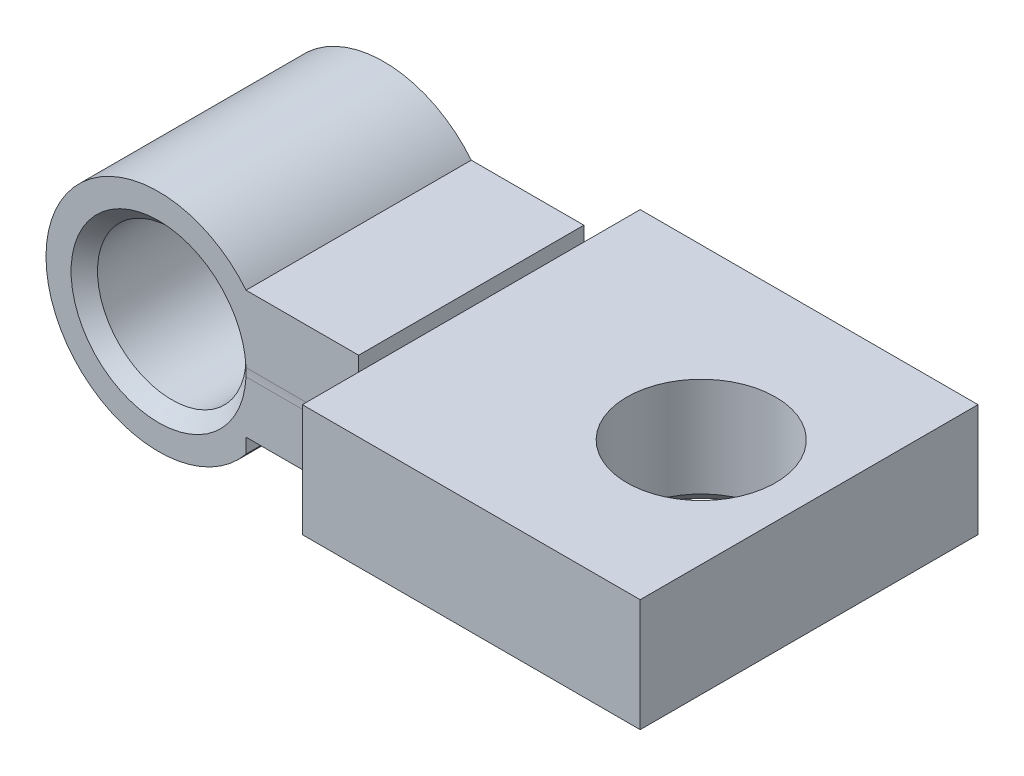
ISO-10303-21;
HEADER;
FILE_DESCRIPTION(('STEP AP214'),'2;1');
FILE_NAME('part.step','',(''),(''),'','','');
FILE_SCHEMA(('AUTOMOTIVE_DESIGN { 1 0 10303 214 1 1 1 1 }'));
ENDSEC;
DATA;
#1=APPLICATION_CONTEXT('core data for automotive mechanical design processes');
#2=APPLICATION_PROTOCOL_DEFINITION('international standard','automotive_design',2000,#1);
#3=PRODUCT_CONTEXT('',#1,'mechanical');
#4=PRODUCT('Part','Part','',(#3));
#5=PRODUCT_RELATED_PRODUCT_CATEGORY('part','',(#4));
#6=PRODUCT_DEFINITION_FORMATION('','',#4);
#7=PRODUCT_DEFINITION_CONTEXT('part definition',#1,'design');
#8=PRODUCT_DEFINITION('design','',#6,#7);
#9=PRODUCT_DEFINITION_SHAPE('','',#8);
#10=(LENGTH_UNIT() NAMED_UNIT(*) SI_UNIT(.MILLI.,.METRE.));
#11=(NAMED_UNIT(*) PLANE_ANGLE_UNIT() SI_UNIT($,.RADIAN.));
#12=(NAMED_UNIT(*) SI_UNIT($,.STERADIAN.) SOLID_ANGLE_UNIT());
#13=UNCERTAINTY_MEASURE_WITH_UNIT(LENGTH_MEASURE(1.E-05),#10,'distance_accuracy_value','');
#14=(GEOMETRIC_REPRESENTATION_CONTEXT(3) GLOBAL_UNCERTAINTY_ASSIGNED_CONTEXT((#13)) GLOBAL_UNIT_ASSIGNED_CONTEXT((#10,
#11,#12)) REPRESENTATION_CONTEXT('',''));
#15=CARTESIAN_POINT('',(0.,0.,0.));
#16=DIRECTION('',(0.,0.,1.));
#17=DIRECTION('',(1.,0.,0.));
#18=AXIS2_PLACEMENT_3D('',#15,#16,#17);
#19=CARTESIAN_POINT('',(3.88246984652232,-6.09266151445271,0.));
#20=DIRECTION('',(-1.,0.,0.));
#21=DIRECTION('',(0.,0.,1.));
#22=AXIS2_PLACEMENT_3D('',#19,#20,#21);
#23=PLANE('',#22);
#24=DIRECTION('',(0.,0.,-1.));
#25=VECTOR('',#24,1.);
#26=CARTESIAN_POINT('',(3.88246984652232,-2.5,0.));
#27=LINE('',#26,#25);
#28=CARTESIAN_POINT('',(3.88246984652232,-2.5,10.));
#29=VERTEX_POINT('',#28);
#30=CARTESIAN_POINT('',(3.88246984652232,-2.5,0.));
#31=VERTEX_POINT('',#30);
#32=EDGE_CURVE('E65',#29,#31,#27,.T.);
#33=ORIENTED_EDGE('',*,*,#32,.F.);
#34=DIRECTION('',(0.,-1.,0.));
#35=VECTOR('',#34,1.);
#36=CARTESIAN_POINT('',(3.88246984652232,-6.09266151445271,10.));
#37=LINE('',#36,#35);
#38=CARTESIAN_POINT('',(3.88246984652232,-3.1506234130478,10.));
#39=VERTEX_POINT('',#38);
#40=EDGE_CURVE('E239',#29,#39,#37,.T.);
#41=ORIENTED_EDGE('',*,*,#40,.T.);
#42=DIRECTION('',(0.,0.,-1.));
#43=VECTOR('',#42,1.);
#44=CARTESIAN_POINT('',(3.88246984652232,-3.1506234130478,10.));
#45=LINE('',#44,#43);
#46=CARTESIAN_POINT('',(3.88246984652232,-3.1506234130478,0.));
#47=VERTEX_POINT('',#46);
#48=EDGE_CURVE('E271',#47,#39,#45,.F.);
#49=ORIENTED_EDGE('',*,*,#48,.F.);
#50=DIRECTION('',(0.,-1.,0.));
#51=VECTOR('',#50,1.);
#52=CARTESIAN_POINT('',(3.88246984652232,-6.09266151445271,0.));
#53=LINE('',#52,#51);
#54=EDGE_CURVE('E259',#31,#47,#53,.T.);
#55=ORIENTED_EDGE('',*,*,#54,.F.);
#56=EDGE_LOOP('',(#33,#41,#49,#55));
#57=FACE_BOUND('',#56,.T.);
#58=ADVANCED_FACE('F40',(#57),#23,.F.);
#59=CARTESIAN_POINT('',(0.,0.,10.));
#60=DIRECTION('',(0.,0.,-1.));
#61=DIRECTION('',(-1.,0.,0.));
#62=AXIS2_PLACEMENT_3D('',#59,#60,#61);
#63=CYLINDRICAL_SURFACE('',#62,5.);
#64=CARTESIAN_POINT('',(0.,0.,0.));
#65=DIRECTION('',(0.,0.,1.));
#66=DIRECTION('',(1.,0.,0.));
#67=AXIS2_PLACEMENT_3D('',#64,#65,#66);
#68=CIRCLE('',#67,5.);
#69=CARTESIAN_POINT('',(3.88246984652232,3.1506234130478,0.));
#70=VERTEX_POINT('',#69);
#71=EDGE_CURVE('E282',#70,#47,#68,.T.);
#72=ORIENTED_EDGE('',*,*,#71,.T.);
#73=ORIENTED_EDGE('',*,*,#48,.T.);
#74=CARTESIAN_POINT('',(0.,0.,10.));
#75=DIRECTION('',(0.,0.,1.));
#76=DIRECTION('',(1.,0.,0.));
#77=AXIS2_PLACEMENT_3D('',#74,#75,#76);
#78=CIRCLE('',#77,5.);
#79=CARTESIAN_POINT('',(3.88246984652232,3.1506234130478,10.));
#80=VERTEX_POINT('',#79);
#81=EDGE_CURVE('E49',#80,#39,#78,.T.);
#82=ORIENTED_EDGE('',*,*,#81,.F.);
#83=DIRECTION('',(0.,0.,1.));
#84=VECTOR('',#83,1.);
#85=CARTESIAN_POINT('',(3.88246984652232,3.1506234130478,0.));
#86=LINE('',#85,#84);
#87=EDGE_CURVE('E268',#70,#80,#86,.T.);
#88=ORIENTED_EDGE('',*,*,#87,.F.);
#89=EDGE_LOOP('',(#72,#73,#82,#88));
#90=FACE_BOUND('',#89,.T.);
#91=ADVANCED_FACE('F42',(#90),#63,.T.);
#92=CARTESIAN_POINT('',(0.,0.,10.));
#93=DIRECTION('',(0.,0.,1.));
#94=DIRECTION('',(1.,0.,0.));
#95=AXIS2_PLACEMENT_3D('',#92,#93,#94);
#96=PLANE('',#95);
#97=CARTESIAN_POINT('',(0.,0.,10.));
#98=DIRECTION('',(0.,0.,1.));
#99=DIRECTION('',(1.,0.,0.));
#100=AXIS2_PLACEMENT_3D('',#97,#98,#99);
#101=CIRCLE('',#100,3.8865);
#102=CARTESIAN_POINT('',(3.88246984652232,0.176946717530785,10.));
#103=VERTEX_POINT('',#102);
#104=CARTESIAN_POINT('',(3.88246984652232,-0.176946717530785,10.));
#105=VERTEX_POINT('',#104);
#106=EDGE_CURVE('E279',#103,#105,#101,.T.);
#107=ORIENTED_EDGE('',*,*,#106,.F.);
#108=DIRECTION('',(-1.,0.,0.));
#109=VECTOR('',#108,1.);
#110=CARTESIAN_POINT('',(8.88246984652232,0.176946717530788,9.99999999999999));
#111=LINE('',#110,#109);
#112=CARTESIAN_POINT('',(8.88246984652232,0.176946717530788,9.99999999999999));
#113=VERTEX_POINT('',#112);
#114=EDGE_CURVE('E236',#113,#103,#111,.T.);
#115=ORIENTED_EDGE('',*,*,#114,.F.);
#116=DIRECTION('',(0.,-1.,0.));
#117=VECTOR('',#116,1.);
#118=CARTESIAN_POINT('',(8.88246984652232,0.,10.));
#119=LINE('',#118,#117);
#120=CARTESIAN_POINT('',(8.88246984652232,2.5,10.));
#121=VERTEX_POINT('',#120);
#122=EDGE_CURVE('E251',#121,#113,#119,.T.);
#123=ORIENTED_EDGE('',*,*,#122,.F.);
#124=CARTESIAN_POINT('',(8.88246984652232,3.1506234130478,10.));
#125=VERTEX_POINT('',#124);
#126=EDGE_CURVE('E244',#125,#121,#119,.T.);
#127=ORIENTED_EDGE('',*,*,#126,.F.);
#128=DIRECTION('',(-1.,0.,0.));
#129=VECTOR('',#128,1.);
#130=CARTESIAN_POINT('',(8.88246984652232,3.1506234130478,10.));
#131=LINE('',#130,#129);
#132=EDGE_CURVE('E232',#125,#80,#131,.T.);
#133=ORIENTED_EDGE('',*,*,#132,.T.);
#134=ORIENTED_EDGE('',*,*,#81,.T.);
#135=ORIENTED_EDGE('',*,*,#40,.F.);
#136=DIRECTION('',(-1.,0.,0.));
#137=VECTOR('',#136,1.);
#138=CARTESIAN_POINT('',(8.88246984652232,-2.5,10.));
#139=LINE('',#138,#137);
#140=CARTESIAN_POINT('',(8.88246984652232,-2.5,10.));
#141=VERTEX_POINT('',#140);
#142=EDGE_CURVE('E227',#141,#29,#139,.T.);
#143=ORIENTED_EDGE('',*,*,#142,.F.);
#144=DIRECTION('',(0.,-1.,0.));
#145=VECTOR('',#144,1.);
#146=CARTESIAN_POINT('',(8.88246984652232,0.,10.));
#147=LINE('',#146,#145);
#148=CARTESIAN_POINT('',(8.88246984652232,-0.176946717530786,10.));
#149=VERTEX_POINT('',#148);
#150=EDGE_CURVE('E228',#149,#141,#147,.T.);
#151=ORIENTED_EDGE('',*,*,#150,.F.);
#152=DIRECTION('',(-1.,0.,0.));
#153=VECTOR('',#152,1.);
#154=CARTESIAN_POINT('',(8.88246984652232,-0.176946717530786,10.));
#155=LINE('',#154,#153);
#156=EDGE_CURVE('E231',#149,#105,#155,.T.);
#157=ORIENTED_EDGE('',*,*,#156,.T.);
#158=EDGE_LOOP('',(#107,#115,#123,#127,#133,#134,#135,#143,#151,#157));
#159=FACE_BOUND('',#158,.T.);
#160=ADVANCED_FACE('F296',(#159),#96,.T.);
#161=CARTESIAN_POINT('',(0.,0.,0.));
#162=DIRECTION('',(0.,0.,1.));
#163=DIRECTION('',(1.,0.,0.));
#164=AXIS2_PLACEMENT_3D('',#161,#162,#163);
#165=PLANE('',#164);
#166=CARTESIAN_POINT('',(0.,0.,0.));
#167=DIRECTION('',(0.,0.,1.));
#168=DIRECTION('',(1.,0.,0.));
#169=AXIS2_PLACEMENT_3D('',#166,#167,#168);
#170=CIRCLE('',#169,3.29999999999999);
#171=CARTESIAN_POINT('',(3.29999999999999,0.,0.));
#172=VERTEX_POINT('',#171);
#173=EDGE_CURVE('E278',#172,#172,#170,.T.);
#174=ORIENTED_EDGE('',*,*,#173,.T.);
#175=EDGE_LOOP('',(#174));
#176=FACE_BOUND('',#175,.T.);
#177=ORIENTED_EDGE('',*,*,#71,.F.);
#178=DIRECTION('',(-1.,0.,0.));
#179=VECTOR('',#178,1.);
#180=CARTESIAN_POINT('',(8.88246984652232,3.1506234130478,0.));
#181=LINE('',#180,#179);
#182=CARTESIAN_POINT('',(8.88246984652232,3.1506234130478,0.));
#183=VERTEX_POINT('',#182);
#184=EDGE_CURVE('E235',#183,#70,#181,.T.);
#185=ORIENTED_EDGE('',*,*,#184,.F.);
#186=DIRECTION('',(0.,1.,0.));
#187=VECTOR('',#186,1.);
#188=CARTESIAN_POINT('',(8.88246984652232,0.,0.));
#189=LINE('',#188,#187);
#190=CARTESIAN_POINT('',(8.88246984652232,2.5,0.));
#191=VERTEX_POINT('',#190);
#192=EDGE_CURVE('E158',#191,#183,#189,.T.);
#193=ORIENTED_EDGE('',*,*,#192,.F.);
#194=CARTESIAN_POINT('',(8.88246984652232,-2.5,0.));
#195=VERTEX_POINT('',#194);
#196=EDGE_CURVE('E175',#195,#191,#189,.T.);
#197=ORIENTED_EDGE('',*,*,#196,.F.);
#198=DIRECTION('',(-1.,0.,0.));
#199=VECTOR('',#198,1.);
#200=CARTESIAN_POINT('',(8.88246984652232,-2.5,0.));
#201=LINE('',#200,#199);
#202=EDGE_CURVE('E224',#195,#31,#201,.T.);
#203=ORIENTED_EDGE('',*,*,#202,.T.);
#204=ORIENTED_EDGE('',*,*,#54,.T.);
#205=EDGE_LOOP('',(#177,#185,#193,#197,#203,#204));
#206=FACE_BOUND('',#205,.T.);
#207=ADVANCED_FACE('F340',(#176,#206),#165,.F.);
#208=CARTESIAN_POINT('',(0.,0.,10.));
#209=DIRECTION('',(0.,0.,1.));
#210=DIRECTION('',(1.,0.,0.));
#211=AXIS2_PLACEMENT_3D('',#208,#209,#210);
#212=CYLINDRICAL_SURFACE('',#211,3.29999999999999);
#213=CARTESIAN_POINT('',(0.,0.,9.41349999999998));
#214=DIRECTION('',(0.,0.,1.));
#215=DIRECTION('',(1.,0.,0.));
#216=AXIS2_PLACEMENT_3D('',#213,#214,#215);
#217=CIRCLE('',#216,3.29999999999999);
#218=CARTESIAN_POINT('',(3.29999999999999,0.,9.41349999999998));
#219=VERTEX_POINT('',#218);
#220=EDGE_CURVE('E275',#219,#219,#217,.T.);
#221=ORIENTED_EDGE('',*,*,#220,.T.);
#222=EDGE_LOOP('',(#221));
#223=FACE_BOUND('',#222,.T.);
#224=ORIENTED_EDGE('',*,*,#173,.F.);
#225=EDGE_LOOP('',(#224));
#226=FACE_BOUND('',#225,.T.);
#227=ADVANCED_FACE('F350',(#223,#226),#212,.F.);
#228=CARTESIAN_POINT('',(0.,0.,10.));
#229=DIRECTION('',(0.,0.,1.));
#230=DIRECTION('',(1.,0.,0.));
#231=AXIS2_PLACEMENT_3D('',#228,#229,#230);
#232=CONICAL_SURFACE('',#231,3.8865,0.785398163397441);
#233=ORIENTED_EDGE('',*,*,#220,.F.);
#234=EDGE_LOOP('',(#233));
#235=FACE_BOUND('',#234,.T.);
#236=ORIENTED_EDGE('',*,*,#106,.T.);
#237=CARTESIAN_POINT('',(3.88246984652232,0.176946717530788,9.99999999999999));
#238=CARTESIAN_POINT('',(3.88246984652232,0.,9.99194387216134));
#239=CARTESIAN_POINT('',(3.88246984652232,-0.176946717530786,9.99999999999999));
#240=B_SPLINE_CURVE_WITH_KNOTS('',2,(#237,#238,#239),.UNSPECIFIED.,.F.,.F.,(3,3),(0.,1.),.UNSPECIFIED.);
#241=EDGE_CURVE('E274',#105,#103,#240,.F.);
#242=ORIENTED_EDGE('',*,*,#241,.T.);
#243=EDGE_LOOP('',(#236,#242));
#244=FACE_BOUND('',#243,.T.);
#245=ADVANCED_FACE('F292',(#235,#244),#232,.F.);
#246=CARTESIAN_POINT('',(8.88246984652232,3.1506234130478,0.));
#247=DIRECTION('',(0.,-1.,0.));
#248=DIRECTION('',(0.,0.,-1.));
#249=AXIS2_PLACEMENT_3D('',#246,#247,#248);
#250=PLANE('',#249);
#251=ORIENTED_EDGE('',*,*,#87,.T.);
#252=ORIENTED_EDGE('',*,*,#132,.F.);
#253=DIRECTION('',(0.,0.,1.));
#254=VECTOR('',#253,1.);
#255=CARTESIAN_POINT('',(8.88246984652232,3.1506234130478,0.));
#256=LINE('',#255,#254);
#257=EDGE_CURVE('E219',#183,#125,#256,.T.);
#258=ORIENTED_EDGE('',*,*,#257,.F.);
#259=ORIENTED_EDGE('',*,*,#184,.T.);
#260=EDGE_LOOP('',(#251,#252,#258,#259));
#261=FACE_BOUND('',#260,.T.);
#262=ADVANCED_FACE('F211',(#261),#250,.F.);
#263=CARTESIAN_POINT('',(8.88246984652232,0.176946717530788,9.99999999999999));
#264=CARTESIAN_POINT('',(8.88246984652232,0.,9.99194387216134));
#265=CARTESIAN_POINT('',(8.88246984652232,-0.176946717530786,9.99999999999999));
#266=B_SPLINE_CURVE_WITH_KNOTS('',2,(#263,#264,#265),.UNSPECIFIED.,.F.,.F.,(3,3),(0.,1.),.UNSPECIFIED.);
#267=DIRECTION('',(-1.,0.,0.));
#268=VECTOR('',#267,1.);
#269=SURFACE_OF_LINEAR_EXTRUSION('',#266,#268);
#270=ORIENTED_EDGE('',*,*,#241,.F.);
#271=ORIENTED_EDGE('',*,*,#156,.F.);
#272=CARTESIAN_POINT('',(8.88246984652232,-0.176946717530786,9.99999999999999));
#273=CARTESIAN_POINT('',(8.88246984652232,0.,9.99194387216134));
#274=CARTESIAN_POINT('',(8.88246984652232,0.176946717530788,9.99999999999999));
#275=B_SPLINE_CURVE_WITH_KNOTS('',2,(#272,#273,#274),.UNSPECIFIED.,.F.,.F.,(3,3),(0.,1.),.UNSPECIFIED.);
#276=EDGE_CURVE('E170',#113,#149,#275,.F.);
#277=ORIENTED_EDGE('',*,*,#276,.F.);
#278=ORIENTED_EDGE('',*,*,#114,.T.);
#279=EDGE_LOOP('',(#270,#271,#277,#278));
#280=FACE_BOUND('',#279,.T.);
#281=ADVANCED_FACE('F205',(#280),#269,.F.);
#282=CARTESIAN_POINT('',(8.88246984652232,-2.5,0.));
#283=DIRECTION('',(0.,1.,0.));
#284=DIRECTION('',(0.,0.,1.));
#285=AXIS2_PLACEMENT_3D('',#282,#283,#284);
#286=PLANE('',#285);
#287=CARTESIAN_POINT('',(19.0931454608073,-2.5,5.));
#288=DIRECTION('',(0.,-1.,0.));
#289=DIRECTION('',(0.,0.,-1.));
#290=AXIS2_PLACEMENT_3D('',#287,#288,#289);
#291=CIRCLE('',#290,3.8865);
#292=CARTESIAN_POINT('',(19.0931454608073,-2.5,1.1135));
#293=VERTEX_POINT('',#292);
#294=EDGE_CURVE('E509',#293,#293,#291,.T.);
#295=ORIENTED_EDGE('',*,*,#294,.F.);
#296=EDGE_LOOP('',(#295));
#297=FACE_BOUND('',#296,.T.);
#298=ORIENTED_EDGE('',*,*,#32,.T.);
#299=ORIENTED_EDGE('',*,*,#202,.F.);
#300=DIRECTION('',(0.,0.,-1.));
#301=VECTOR('',#300,1.);
#302=CARTESIAN_POINT('',(8.88246984652232,-2.5,12.5));
#303=LINE('',#302,#301);
#304=CARTESIAN_POINT('',(8.88246984652232,-2.5,-2.5));
#305=VERTEX_POINT('',#304);
#306=EDGE_CURVE('E320',#195,#305,#303,.T.);
#307=ORIENTED_EDGE('',*,*,#306,.T.);
#308=DIRECTION('',(-1.,0.,0.));
#309=VECTOR('',#308,1.);
#310=CARTESIAN_POINT('',(23.8824698465223,-2.5,-2.5));
#311=LINE('',#310,#309);
#312=CARTESIAN_POINT('',(23.8824698465223,-2.5,-2.5));
#313=VERTEX_POINT('',#312);
#314=EDGE_CURVE('E325',#313,#305,#311,.T.);
#315=ORIENTED_EDGE('',*,*,#314,.F.);
#316=DIRECTION('',(0.,0.,-1.));
#317=VECTOR('',#316,1.);
#318=CARTESIAN_POINT('',(23.8824698465223,-2.5,12.5));
#319=LINE('',#318,#317);
#320=CARTESIAN_POINT('',(23.8824698465223,-2.5,12.5));
#321=VERTEX_POINT('',#320);
#322=EDGE_CURVE('E148',#321,#313,#319,.T.);
#323=ORIENTED_EDGE('',*,*,#322,.F.);
#324=DIRECTION('',(-1.,0.,0.));
#325=VECTOR('',#324,1.);
#326=CARTESIAN_POINT('',(23.8824698465223,-2.5,12.5));
#327=LINE('',#326,#325);
#328=CARTESIAN_POINT('',(8.88246984652232,-2.5,12.5));
#329=VERTEX_POINT('',#328);
#330=EDGE_CURVE('E160',#321,#329,#327,.T.);
#331=ORIENTED_EDGE('',*,*,#330,.T.);
#332=EDGE_CURVE('E152',#329,#141,#303,.T.);
#333=ORIENTED_EDGE('',*,*,#332,.T.);
#334=ORIENTED_EDGE('',*,*,#142,.T.);
#335=EDGE_LOOP('',(#298,#299,#307,#315,#323,#331,#333,#334));
#336=FACE_BOUND('',#335,.T.);
#337=ADVANCED_FACE('F202',(#297,#336),#286,.F.);
#338=CARTESIAN_POINT('',(8.88246984652232,0.,0.));
#339=DIRECTION('',(1.,0.,0.));
#340=DIRECTION('',(0.,0.,-1.));
#341=AXIS2_PLACEMENT_3D('',#338,#339,#340);
#342=PLANE('',#341);
#343=DIRECTION('',(0.,0.,1.));
#344=VECTOR('',#343,1.);
#345=CARTESIAN_POINT('',(8.88246984652232,2.5,12.5));
#346=LINE('',#345,#344);
#347=EDGE_CURVE('E11',#191,#121,#346,.T.);
#348=ORIENTED_EDGE('',*,*,#347,.F.);
#349=ORIENTED_EDGE('',*,*,#192,.T.);
#350=ORIENTED_EDGE('',*,*,#257,.T.);
#351=ORIENTED_EDGE('',*,*,#126,.T.);
#352=EDGE_LOOP('',(#348,#349,#350,#351));
#353=FACE_BOUND('',#352,.T.);
#354=ADVANCED_FACE('F199',(#353),#342,.T.);
#355=CARTESIAN_POINT('',(8.88246984652232,0.,0.));
#356=DIRECTION('',(-1.,0.,0.));
#357=DIRECTION('',(0.,0.,1.));
#358=AXIS2_PLACEMENT_3D('',#355,#356,#357);
#359=PLANE('',#358);
#360=ORIENTED_EDGE('',*,*,#306,.F.);
#361=ORIENTED_EDGE('',*,*,#196,.T.);
#362=CARTESIAN_POINT('',(8.88246984652232,2.5,-2.5));
#363=VERTEX_POINT('',#362);
#364=EDGE_CURVE('E51',#363,#191,#346,.T.);
#365=ORIENTED_EDGE('',*,*,#364,.F.);
#366=DIRECTION('',(0.,1.,0.));
#367=VECTOR('',#366,1.);
#368=CARTESIAN_POINT('',(8.88246984652232,-2.5,-2.5));
#369=LINE('',#368,#367);
#370=EDGE_CURVE('E156',#305,#363,#369,.T.);
#371=ORIENTED_EDGE('',*,*,#370,.F.);
#372=EDGE_LOOP('',(#360,#361,#365,#371));
#373=FACE_BOUND('',#372,.T.);
#374=ADVANCED_FACE('F188',(#373),#359,.T.);
#375=CARTESIAN_POINT('',(23.8824698465223,-2.5,-2.5));
#376=DIRECTION('',(0.,0.,1.));
#377=DIRECTION('',(1.,0.,0.));
#378=AXIS2_PLACEMENT_3D('',#375,#376,#377);
#379=PLANE('',#378);
#380=ORIENTED_EDGE('',*,*,#370,.T.);
#381=DIRECTION('',(-1.,0.,0.));
#382=VECTOR('',#381,1.);
#383=CARTESIAN_POINT('',(23.8824698465223,2.5,-2.5));
#384=LINE('',#383,#382);
#385=CARTESIAN_POINT('',(23.8824698465223,2.5,-2.5));
#386=VERTEX_POINT('',#385);
#387=EDGE_CURVE('E136',#386,#363,#384,.T.);
#388=ORIENTED_EDGE('',*,*,#387,.F.);
#389=DIRECTION('',(0.,1.,0.));
#390=VECTOR('',#389,1.);
#391=CARTESIAN_POINT('',(23.8824698465223,-2.5,-2.5));
#392=LINE('',#391,#390);
#393=EDGE_CURVE('E143',#313,#386,#392,.T.);
#394=ORIENTED_EDGE('',*,*,#393,.F.);
#395=ORIENTED_EDGE('',*,*,#314,.T.);
#396=EDGE_LOOP('',(#380,#388,#394,#395));
#397=FACE_BOUND('',#396,.T.);
#398=ADVANCED_FACE('F154',(#397),#379,.F.);
#399=CARTESIAN_POINT('',(23.8824698465223,2.5,12.5));
#400=DIRECTION('',(0.,-1.,0.));
#401=DIRECTION('',(0.,0.,-1.));
#402=AXIS2_PLACEMENT_3D('',#399,#400,#401);
#403=PLANE('',#402);
#404=CARTESIAN_POINT('',(19.0931454608073,2.5,5.));
#405=DIRECTION('',(0.,-1.,0.));
#406=DIRECTION('',(0.,0.,-1.));
#407=AXIS2_PLACEMENT_3D('',#404,#405,#406);
#408=CIRCLE('',#407,3.29999999999998);
#409=CARTESIAN_POINT('',(19.0931454608073,2.5,1.70000000000002));
#410=VERTEX_POINT('',#409);
#411=EDGE_CURVE('E44',#410,#410,#408,.T.);
#412=ORIENTED_EDGE('',*,*,#411,.T.);
#413=EDGE_LOOP('',(#412));
#414=FACE_BOUND('',#413,.T.);
#415=ORIENTED_EDGE('',*,*,#364,.T.);
#416=ORIENTED_EDGE('',*,*,#347,.T.);
#417=CARTESIAN_POINT('',(8.88246984652232,2.5,12.5));
#418=VERTEX_POINT('',#417);
#419=EDGE_CURVE('E52',#121,#418,#346,.T.);
#420=ORIENTED_EDGE('',*,*,#419,.T.);
#421=DIRECTION('',(-1.,0.,0.));
#422=VECTOR('',#421,1.);
#423=CARTESIAN_POINT('',(23.8824698465223,2.5,12.5));
#424=LINE('',#423,#422);
#425=CARTESIAN_POINT('',(23.8824698465223,2.5,12.5));
#426=VERTEX_POINT('',#425);
#427=EDGE_CURVE('E139',#426,#418,#424,.T.);
#428=ORIENTED_EDGE('',*,*,#427,.F.);
#429=DIRECTION('',(0.,0.,1.));
#430=VECTOR('',#429,1.);
#431=CARTESIAN_POINT('',(23.8824698465223,2.5,12.5));
#432=LINE('',#431,#430);
#433=EDGE_CURVE('E131',#386,#426,#432,.T.);
#434=ORIENTED_EDGE('',*,*,#433,.F.);
#435=ORIENTED_EDGE('',*,*,#387,.T.);
#436=EDGE_LOOP('',(#415,#416,#420,#428,#434,#435));
#437=FACE_BOUND('',#436,.T.);
#438=ADVANCED_FACE('F134',(#414,#437),#403,.F.);
#439=CARTESIAN_POINT('',(23.8824698465223,-2.5,12.5));
#440=DIRECTION('',(0.,0.,-1.));
#441=DIRECTION('',(-1.,0.,0.));
#442=AXIS2_PLACEMENT_3D('',#439,#440,#441);
#443=PLANE('',#442);
#444=DIRECTION('',(0.,-1.,0.));
#445=VECTOR('',#444,1.);
#446=CARTESIAN_POINT('',(8.88246984652232,-2.5,12.5));
#447=LINE('',#446,#445);
#448=EDGE_CURVE('E322',#418,#329,#447,.T.);
#449=ORIENTED_EDGE('',*,*,#448,.T.);
#450=ORIENTED_EDGE('',*,*,#330,.F.);
#451=DIRECTION('',(0.,-1.,0.));
#452=VECTOR('',#451,1.);
#453=CARTESIAN_POINT('',(23.8824698465223,-2.5,12.5));
#454=LINE('',#453,#452);
#455=EDGE_CURVE('E142',#426,#321,#454,.T.);
#456=ORIENTED_EDGE('',*,*,#455,.F.);
#457=ORIENTED_EDGE('',*,*,#427,.T.);
#458=EDGE_LOOP('',(#449,#450,#456,#457));
#459=FACE_BOUND('',#458,.T.);
#460=ADVANCED_FACE('F190',(#459),#443,.F.);
#461=CARTESIAN_POINT('',(23.8824698465223,0.,0.));
#462=DIRECTION('',(-1.,0.,0.));
#463=DIRECTION('',(0.,0.,1.));
#464=AXIS2_PLACEMENT_3D('',#461,#462,#463);
#465=PLANE('',#464);
#466=ORIENTED_EDGE('',*,*,#393,.T.);
#467=ORIENTED_EDGE('',*,*,#433,.T.);
#468=ORIENTED_EDGE('',*,*,#455,.T.);
#469=ORIENTED_EDGE('',*,*,#322,.T.);
#470=EDGE_LOOP('',(#466,#467,#468,#469));
#471=FACE_BOUND('',#470,.T.);
#472=ADVANCED_FACE('F146',(#471),#465,.F.);
#473=ORIENTED_EDGE('',*,*,#419,.F.);
#474=ORIENTED_EDGE('',*,*,#122,.T.);
#475=ORIENTED_EDGE('',*,*,#276,.T.);
#476=ORIENTED_EDGE('',*,*,#150,.T.);
#477=ORIENTED_EDGE('',*,*,#332,.F.);
#478=ORIENTED_EDGE('',*,*,#448,.F.);
#479=EDGE_LOOP('',(#473,#474,#475,#476,#477,#478));
#480=FACE_BOUND('',#479,.T.);
#481=ADVANCED_FACE('F177',(#480),#359,.T.);
#482=CARTESIAN_POINT('',(19.0931454608073,-2.5,5.));
#483=DIRECTION('',(0.,-1.,0.));
#484=DIRECTION('',(0.,0.,-1.));
#485=AXIS2_PLACEMENT_3D('',#482,#483,#484);
#486=CYLINDRICAL_SURFACE('',#485,3.29999999999998);
#487=CARTESIAN_POINT('',(19.0931454608073,-1.91349999999998,5.));
#488=DIRECTION('',(0.,-1.,0.));
#489=DIRECTION('',(0.,0.,-1.));
#490=AXIS2_PLACEMENT_3D('',#487,#488,#489);
#491=CIRCLE('',#490,3.29999999999999);
#492=CARTESIAN_POINT('',(19.0931454608073,-1.91349999999998,1.70000000000001));
#493=VERTEX_POINT('',#492);
#494=EDGE_CURVE('E506',#493,#493,#491,.T.);
#495=ORIENTED_EDGE('',*,*,#494,.T.);
#496=EDGE_LOOP('',(#495));
#497=FACE_BOUND('',#496,.T.);
#498=ORIENTED_EDGE('',*,*,#411,.F.);
#499=EDGE_LOOP('',(#498));
#500=FACE_BOUND('',#499,.T.);
#501=ADVANCED_FACE('F187',(#497,#500),#486,.F.);
#502=CARTESIAN_POINT('',(19.0931454608073,-2.5,5.));
#503=DIRECTION('',(0.,-1.,0.));
#504=DIRECTION('',(0.,0.,-1.));
#505=AXIS2_PLACEMENT_3D('',#502,#503,#504);
#506=CONICAL_SURFACE('',#505,3.8865,0.785398163397441);
#507=ORIENTED_EDGE('',*,*,#494,.F.);
#508=EDGE_LOOP('',(#507));
#509=FACE_BOUND('',#508,.T.);
#510=ORIENTED_EDGE('',*,*,#294,.T.);
#511=EDGE_LOOP('',(#510));
#512=FACE_BOUND('',#511,.T.);
#513=ADVANCED_FACE('F423',(#509,#512),#506,.F.);
#514=CLOSED_SHELL('',(#58,#91,#160,#207,#227,#245,#262,#281,#337,#354,#374,#398,#438,#460,#472,
#481,#501,#513));
#515=MANIFOLD_SOLID_BREP('B2',#514);
#516=ADVANCED_BREP_SHAPE_REPRESENTATION('',(#18,#515),#14);
#517=SHAPE_DEFINITION_REPRESENTATION(#9,#516);
ENDSEC;
END-ISO-10303-21;
